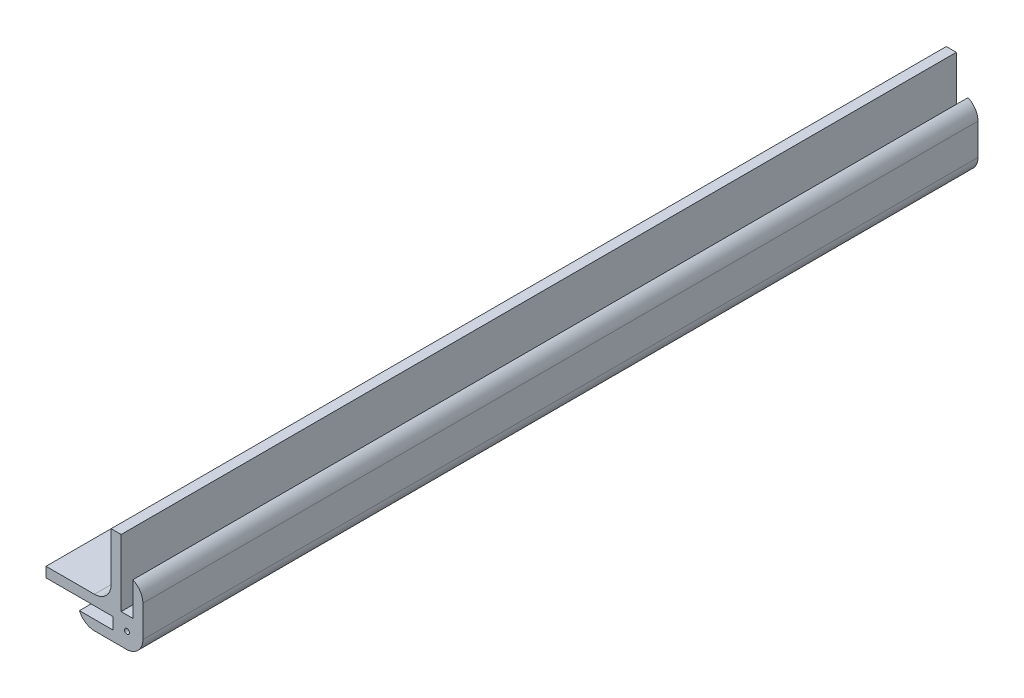
ISO-10303-21;
HEADER;
FILE_DESCRIPTION(('STEP AP214'),'2;1');
FILE_NAME('part.step','',(''),(''),'','','');
FILE_SCHEMA(('AUTOMOTIVE_DESIGN { 1 0 10303 214 1 1 1 1 }'));
ENDSEC;
DATA;
#1=APPLICATION_CONTEXT('core data for automotive mechanical design processes');
#2=APPLICATION_PROTOCOL_DEFINITION('international standard','automotive_design',2000,#1);
#3=PRODUCT_CONTEXT('',#1,'mechanical');
#4=PRODUCT('Part','Part','',(#3));
#5=PRODUCT_RELATED_PRODUCT_CATEGORY('part','',(#4));
#6=PRODUCT_DEFINITION_FORMATION('','',#4);
#7=PRODUCT_DEFINITION_CONTEXT('part definition',#1,'design');
#8=PRODUCT_DEFINITION('design','',#6,#7);
#9=PRODUCT_DEFINITION_SHAPE('','',#8);
#10=(LENGTH_UNIT() NAMED_UNIT(*) SI_UNIT(.MILLI.,.METRE.));
#11=(NAMED_UNIT(*) PLANE_ANGLE_UNIT() SI_UNIT($,.RADIAN.));
#12=(NAMED_UNIT(*) SI_UNIT($,.STERADIAN.) SOLID_ANGLE_UNIT());
#13=UNCERTAINTY_MEASURE_WITH_UNIT(LENGTH_MEASURE(1.E-05),#10,'distance_accuracy_value','');
#14=(GEOMETRIC_REPRESENTATION_CONTEXT(3) GLOBAL_UNCERTAINTY_ASSIGNED_CONTEXT((#13)) GLOBAL_UNIT_ASSIGNED_CONTEXT((#10,
#11,#12)) REPRESENTATION_CONTEXT('',''));
#15=CARTESIAN_POINT('',(0.,0.,0.));
#16=DIRECTION('',(0.,0.,1.));
#17=DIRECTION('',(1.,0.,0.));
#18=AXIS2_PLACEMENT_3D('',#15,#16,#17);
#19=CARTESIAN_POINT('',(0.,0.,250.));
#20=DIRECTION('',(-1.,0.,0.));
#21=DIRECTION('',(0.,-1.,0.));
#22=AXIS2_PLACEMENT_3D('',#19,#20,#21);
#23=PLANE('',#22);
#24=DIRECTION('',(0.,1.,0.));
#25=VECTOR('',#24,1.);
#26=CARTESIAN_POINT('',(0.,-2.99999999999999,250.));
#27=LINE('',#26,#25);
#28=CARTESIAN_POINT('',(0.,2.00000000000001,250.));
#29=VERTEX_POINT('',#28);
#30=CARTESIAN_POINT('',(0.,11.4174243050442,250.));
#31=VERTEX_POINT('',#30);
#32=EDGE_CURVE('E157',#29,#31,#27,.T.);
#33=ORIENTED_EDGE('',*,*,#32,.F.);
#34=DIRECTION('',(0.,0.,-1.));
#35=VECTOR('',#34,1.);
#36=CARTESIAN_POINT('',(0.,2.00000000000001,250.));
#37=LINE('',#36,#35);
#38=CARTESIAN_POINT('',(0.,2.00000000000001,0.));
#39=VERTEX_POINT('',#38);
#40=EDGE_CURVE('E210',#29,#39,#37,.T.);
#41=ORIENTED_EDGE('',*,*,#40,.T.);
#42=DIRECTION('',(0.,1.,0.));
#43=VECTOR('',#42,1.);
#44=CARTESIAN_POINT('',(0.,0.,0.));
#45=LINE('',#44,#43);
#46=CARTESIAN_POINT('',(0.,11.4174243050442,0.));
#47=VERTEX_POINT('',#46);
#48=EDGE_CURVE('E271',#39,#47,#45,.T.);
#49=ORIENTED_EDGE('',*,*,#48,.T.);
#50=DIRECTION('',(0.,0.,1.));
#51=VECTOR('',#50,1.);
#52=CARTESIAN_POINT('',(0.,11.4174243050442,250.));
#53=LINE('',#52,#51);
#54=EDGE_CURVE('E55',#47,#31,#53,.T.);
#55=ORIENTED_EDGE('',*,*,#54,.T.);
#56=EDGE_LOOP('',(#33,#41,#49,#55));
#57=FACE_BOUND('',#56,.T.);
#58=ADVANCED_FACE('F39',(#57),#23,.F.);
#59=CARTESIAN_POINT('',(-3.,16.,250.));
#60=DIRECTION('',(1.,0.,0.));
#61=DIRECTION('',(0.,1.,0.));
#62=AXIS2_PLACEMENT_3D('',#59,#60,#61);
#63=PLANE('',#62);
#64=DIRECTION('',(0.,-1.,0.));
#65=VECTOR('',#64,1.);
#66=CARTESIAN_POINT('',(-3.,16.,0.));
#67=LINE('',#66,#65);
#68=CARTESIAN_POINT('',(-3.,16.,0.));
#69=VERTEX_POINT('',#68);
#70=CARTESIAN_POINT('',(-3.,6.,0.));
#71=VERTEX_POINT('',#70);
#72=EDGE_CURVE('E274',#69,#71,#67,.T.);
#73=ORIENTED_EDGE('',*,*,#72,.T.);
#74=DIRECTION('',(0.,0.,-1.));
#75=VECTOR('',#74,1.);
#76=CARTESIAN_POINT('',(-3.,6.,250.));
#77=LINE('',#76,#75);
#78=CARTESIAN_POINT('',(-3.,6.,250.));
#79=VERTEX_POINT('',#78);
#80=EDGE_CURVE('E169',#79,#71,#77,.T.);
#81=ORIENTED_EDGE('',*,*,#80,.F.);
#82=DIRECTION('',(0.,-1.,0.));
#83=VECTOR('',#82,1.);
#84=CARTESIAN_POINT('',(-3.,16.,250.));
#85=LINE('',#84,#83);
#86=CARTESIAN_POINT('',(-3.,16.,250.));
#87=VERTEX_POINT('',#86);
#88=EDGE_CURVE('E155',#87,#79,#85,.T.);
#89=ORIENTED_EDGE('',*,*,#88,.F.);
#90=DIRECTION('',(0.,0.,-1.));
#91=VECTOR('',#90,1.);
#92=CARTESIAN_POINT('',(-3.,16.,250.));
#93=LINE('',#92,#91);
#94=EDGE_CURVE('E166',#87,#69,#93,.T.);
#95=ORIENTED_EDGE('',*,*,#94,.T.);
#96=EDGE_LOOP('',(#73,#81,#89,#95));
#97=FACE_BOUND('',#96,.T.);
#98=ADVANCED_FACE('F165',(#97),#63,.F.);
#99=CARTESIAN_POINT('',(-6.5,6.,250.));
#100=DIRECTION('',(0.,-1.,0.));
#101=DIRECTION('',(0.,0.,-1.));
#102=AXIS2_PLACEMENT_3D('',#99,#100,#101);
#103=PLANE('',#102);
#104=DIRECTION('',(-1.,0.,0.));
#105=VECTOR('',#104,1.);
#106=CARTESIAN_POINT('',(-6.5,6.,0.));
#107=LINE('',#106,#105);
#108=CARTESIAN_POINT('',(-6.5,6.,0.));
#109=VERTEX_POINT('',#108);
#110=EDGE_CURVE('E278',#71,#109,#107,.T.);
#111=ORIENTED_EDGE('',*,*,#110,.T.);
#112=DIRECTION('',(0.,0.,-1.));
#113=VECTOR('',#112,1.);
#114=CARTESIAN_POINT('',(-6.5,6.,250.));
#115=LINE('',#114,#113);
#116=CARTESIAN_POINT('',(-6.5,6.,250.));
#117=VERTEX_POINT('',#116);
#118=EDGE_CURVE('E183',#117,#109,#115,.T.);
#119=ORIENTED_EDGE('',*,*,#118,.F.);
#120=DIRECTION('',(-1.,0.,0.));
#121=VECTOR('',#120,1.);
#122=CARTESIAN_POINT('',(-6.5,6.,250.));
#123=LINE('',#122,#121);
#124=EDGE_CURVE('E172',#79,#117,#123,.T.);
#125=ORIENTED_EDGE('',*,*,#124,.F.);
#126=ORIENTED_EDGE('',*,*,#80,.T.);
#127=EDGE_LOOP('',(#111,#119,#125,#126));
#128=FACE_BOUND('',#127,.T.);
#129=ADVANCED_FACE('F392',(#128),#103,.F.);
#130=CARTESIAN_POINT('',(-6.5,6.,250.));
#131=DIRECTION('',(-1.,0.,0.));
#132=DIRECTION('',(0.,-1.,0.));
#133=AXIS2_PLACEMENT_3D('',#130,#131,#132);
#134=PLANE('',#133);
#135=DIRECTION('',(0.,1.,0.));
#136=VECTOR('',#135,1.);
#137=CARTESIAN_POINT('',(-6.5,6.,0.));
#138=LINE('',#137,#136);
#139=CARTESIAN_POINT('',(-6.5,26.,0.));
#140=VERTEX_POINT('',#139);
#141=EDGE_CURVE('E281',#109,#140,#138,.T.);
#142=ORIENTED_EDGE('',*,*,#141,.T.);
#143=DIRECTION('',(0.,0.,-1.));
#144=VECTOR('',#143,1.);
#145=CARTESIAN_POINT('',(-6.5,26.,250.));
#146=LINE('',#145,#144);
#147=CARTESIAN_POINT('',(-6.5,26.,250.));
#148=VERTEX_POINT('',#147);
#149=EDGE_CURVE('E324',#148,#140,#146,.T.);
#150=ORIENTED_EDGE('',*,*,#149,.F.);
#151=DIRECTION('',(0.,1.,0.));
#152=VECTOR('',#151,1.);
#153=CARTESIAN_POINT('',(-6.5,6.,250.));
#154=LINE('',#153,#152);
#155=EDGE_CURVE('E335',#117,#148,#154,.T.);
#156=ORIENTED_EDGE('',*,*,#155,.F.);
#157=ORIENTED_EDGE('',*,*,#118,.T.);
#158=EDGE_LOOP('',(#142,#150,#156,#157));
#159=FACE_BOUND('',#158,.T.);
#160=ADVANCED_FACE('F333',(#159),#134,.F.);
#161=CARTESIAN_POINT('',(-6.5,26.,250.));
#162=DIRECTION('',(0.,-1.,0.));
#163=DIRECTION('',(1.,0.,0.));
#164=AXIS2_PLACEMENT_3D('',#161,#162,#163);
#165=PLANE('',#164);
#166=DIRECTION('',(-1.,0.,0.));
#167=VECTOR('',#166,1.);
#168=CARTESIAN_POINT('',(-6.5,26.,0.));
#169=LINE('',#168,#167);
#170=CARTESIAN_POINT('',(-9.5,26.,0.));
#171=VERTEX_POINT('',#170);
#172=EDGE_CURVE('E235',#140,#171,#169,.T.);
#173=ORIENTED_EDGE('',*,*,#172,.T.);
#174=DIRECTION('',(0.,0.,-1.));
#175=VECTOR('',#174,1.);
#176=CARTESIAN_POINT('',(-9.5,26.,250.));
#177=LINE('',#176,#175);
#178=CARTESIAN_POINT('',(-9.5,26.,250.));
#179=VERTEX_POINT('',#178);
#180=EDGE_CURVE('E233',#179,#171,#177,.T.);
#181=ORIENTED_EDGE('',*,*,#180,.F.);
#182=DIRECTION('',(-1.,0.,0.));
#183=VECTOR('',#182,1.);
#184=CARTESIAN_POINT('',(-6.5,26.,250.));
#185=LINE('',#184,#183);
#186=EDGE_CURVE('E255',#148,#179,#185,.T.);
#187=ORIENTED_EDGE('',*,*,#186,.F.);
#188=ORIENTED_EDGE('',*,*,#149,.T.);
#189=EDGE_LOOP('',(#173,#181,#187,#188));
#190=FACE_BOUND('',#189,.T.);
#191=ADVANCED_FACE('F339',(#190),#165,.F.);
#192=CARTESIAN_POINT('',(-9.5,26.,250.));
#193=DIRECTION('',(1.,0.,0.));
#194=DIRECTION('',(0.,1.,0.));
#195=AXIS2_PLACEMENT_3D('',#192,#193,#194);
#196=PLANE('',#195);
#197=DIRECTION('',(0.,-1.,0.));
#198=VECTOR('',#197,1.);
#199=CARTESIAN_POINT('',(-9.5,26.,0.));
#200=LINE('',#199,#198);
#201=CARTESIAN_POINT('',(-9.49999999999999,11.5,0.));
#202=VERTEX_POINT('',#201);
#203=EDGE_CURVE('E221',#171,#202,#200,.T.);
#204=ORIENTED_EDGE('',*,*,#203,.T.);
#205=DIRECTION('',(0.,0.,-1.));
#206=VECTOR('',#205,1.);
#207=CARTESIAN_POINT('',(-9.49999999999999,11.5,250.));
#208=LINE('',#207,#206);
#209=CARTESIAN_POINT('',(-9.49999999999999,11.5,250.));
#210=VERTEX_POINT('',#209);
#211=EDGE_CURVE('E181',#202,#210,#208,.F.);
#212=ORIENTED_EDGE('',*,*,#211,.T.);
#213=DIRECTION('',(0.,-1.,0.));
#214=VECTOR('',#213,1.);
#215=CARTESIAN_POINT('',(-9.5,26.,250.));
#216=LINE('',#215,#214);
#217=EDGE_CURVE('E242',#179,#210,#216,.T.);
#218=ORIENTED_EDGE('',*,*,#217,.F.);
#219=ORIENTED_EDGE('',*,*,#180,.T.);
#220=EDGE_LOOP('',(#204,#212,#218,#219));
#221=FACE_BOUND('',#220,.T.);
#222=ADVANCED_FACE('F229',(#221),#196,.F.);
#223=CARTESIAN_POINT('',(-9.49999999999999,6.5,250.));
#224=DIRECTION('',(0.,-1.,0.));
#225=DIRECTION('',(1.,0.,0.));
#226=AXIS2_PLACEMENT_3D('',#223,#224,#225);
#227=PLANE('',#226);
#228=DIRECTION('',(-1.,0.,0.));
#229=VECTOR('',#228,1.);
#230=CARTESIAN_POINT('',(-9.49999999999999,6.5,250.));
#231=LINE('',#230,#229);
#232=CARTESIAN_POINT('',(-14.5,6.5,250.));
#233=VERTEX_POINT('',#232);
#234=CARTESIAN_POINT('',(-29.,6.5,250.));
#235=VERTEX_POINT('',#234);
#236=EDGE_CURVE('E240',#233,#235,#231,.T.);
#237=ORIENTED_EDGE('',*,*,#236,.F.);
#238=DIRECTION('',(0.,0.,-1.));
#239=VECTOR('',#238,1.);
#240=CARTESIAN_POINT('',(-14.5,6.5,0.));
#241=LINE('',#240,#239);
#242=CARTESIAN_POINT('',(-14.5,6.5,0.));
#243=VERTEX_POINT('',#242);
#244=EDGE_CURVE('E176',#233,#243,#241,.T.);
#245=ORIENTED_EDGE('',*,*,#244,.T.);
#246=DIRECTION('',(-1.,0.,0.));
#247=VECTOR('',#246,1.);
#248=CARTESIAN_POINT('',(-9.49999999999999,6.5,0.));
#249=LINE('',#248,#247);
#250=CARTESIAN_POINT('',(-29.,6.5,0.));
#251=VERTEX_POINT('',#250);
#252=EDGE_CURVE('E223',#243,#251,#249,.T.);
#253=ORIENTED_EDGE('',*,*,#252,.T.);
#254=DIRECTION('',(0.,0.,-1.));
#255=VECTOR('',#254,1.);
#256=CARTESIAN_POINT('',(-29.,6.5,250.));
#257=LINE('',#256,#255);
#258=EDGE_CURVE('E246',#235,#251,#257,.T.);
#259=ORIENTED_EDGE('',*,*,#258,.F.);
#260=EDGE_LOOP('',(#237,#245,#253,#259));
#261=FACE_BOUND('',#260,.T.);
#262=ADVANCED_FACE('F244',(#261),#227,.F.);
#263=CARTESIAN_POINT('',(-29.,6.5,250.));
#264=DIRECTION('',(1.,0.,0.));
#265=DIRECTION('',(0.,1.,0.));
#266=AXIS2_PLACEMENT_3D('',#263,#264,#265);
#267=PLANE('',#266);
#268=DIRECTION('',(0.,-1.,0.));
#269=VECTOR('',#268,1.);
#270=CARTESIAN_POINT('',(-29.,6.5,0.));
#271=LINE('',#270,#269);
#272=CARTESIAN_POINT('',(-29.,3.5,0.));
#273=VERTEX_POINT('',#272);
#274=EDGE_CURVE('E288',#251,#273,#271,.T.);
#275=ORIENTED_EDGE('',*,*,#274,.T.);
#276=DIRECTION('',(0.,0.,-1.));
#277=VECTOR('',#276,1.);
#278=CARTESIAN_POINT('',(-29.,3.5,250.));
#279=LINE('',#278,#277);
#280=CARTESIAN_POINT('',(-29.,3.5,250.));
#281=VERTEX_POINT('',#280);
#282=EDGE_CURVE('E316',#281,#273,#279,.T.);
#283=ORIENTED_EDGE('',*,*,#282,.F.);
#284=DIRECTION('',(0.,-1.,0.));
#285=VECTOR('',#284,1.);
#286=CARTESIAN_POINT('',(-29.,6.5,250.));
#287=LINE('',#286,#285);
#288=EDGE_CURVE('E249',#235,#281,#287,.T.);
#289=ORIENTED_EDGE('',*,*,#288,.F.);
#290=ORIENTED_EDGE('',*,*,#258,.T.);
#291=EDGE_LOOP('',(#275,#283,#289,#290));
#292=FACE_BOUND('',#291,.T.);
#293=ADVANCED_FACE('F423',(#292),#267,.F.);
#294=CARTESIAN_POINT('',(-29.,3.5,250.));
#295=DIRECTION('',(0.,1.,0.));
#296=DIRECTION('',(-1.,0.,0.));
#297=AXIS2_PLACEMENT_3D('',#294,#295,#296);
#298=PLANE('',#297);
#299=DIRECTION('',(1.,0.,0.));
#300=VECTOR('',#299,1.);
#301=CARTESIAN_POINT('',(-29.,3.5,0.));
#302=LINE('',#301,#300);
#303=CARTESIAN_POINT('',(-9.,3.5,0.));
#304=VERTEX_POINT('',#303);
#305=EDGE_CURVE('E291',#273,#304,#302,.T.);
#306=ORIENTED_EDGE('',*,*,#305,.T.);
#307=DIRECTION('',(0.,0.,-1.));
#308=VECTOR('',#307,1.);
#309=CARTESIAN_POINT('',(-9.,3.5,250.));
#310=LINE('',#309,#308);
#311=CARTESIAN_POINT('',(-9.,3.5,250.));
#312=VERTEX_POINT('',#311);
#313=EDGE_CURVE('E312',#312,#304,#310,.T.);
#314=ORIENTED_EDGE('',*,*,#313,.F.);
#315=DIRECTION('',(1.,0.,0.));
#316=VECTOR('',#315,1.);
#317=CARTESIAN_POINT('',(-29.,3.5,250.));
#318=LINE('',#317,#316);
#319=EDGE_CURVE('E253',#281,#312,#318,.T.);
#320=ORIENTED_EDGE('',*,*,#319,.F.);
#321=ORIENTED_EDGE('',*,*,#282,.T.);
#322=EDGE_LOOP('',(#306,#314,#320,#321));
#323=FACE_BOUND('',#322,.T.);
#324=ADVANCED_FACE('F426',(#323),#298,.F.);
#325=CARTESIAN_POINT('',(-9.,3.5,250.));
#326=DIRECTION('',(1.,0.,0.));
#327=DIRECTION('',(0.,1.,0.));
#328=AXIS2_PLACEMENT_3D('',#325,#326,#327);
#329=PLANE('',#328);
#330=DIRECTION('',(0.,-1.,0.));
#331=VECTOR('',#330,1.);
#332=CARTESIAN_POINT('',(-9.,3.5,0.));
#333=LINE('',#332,#331);
#334=CARTESIAN_POINT('',(-9.,0.,0.));
#335=VERTEX_POINT('',#334);
#336=EDGE_CURVE('E294',#304,#335,#333,.T.);
#337=ORIENTED_EDGE('',*,*,#336,.T.);
#338=DIRECTION('',(0.,0.,-1.));
#339=VECTOR('',#338,1.);
#340=CARTESIAN_POINT('',(-9.,0.,250.));
#341=LINE('',#340,#339);
#342=CARTESIAN_POINT('',(-9.,0.,250.));
#343=VERTEX_POINT('',#342);
#344=EDGE_CURVE('E308',#343,#335,#341,.T.);
#345=ORIENTED_EDGE('',*,*,#344,.F.);
#346=DIRECTION('',(0.,-1.,0.));
#347=VECTOR('',#346,1.);
#348=CARTESIAN_POINT('',(-9.,3.5,250.));
#349=LINE('',#348,#347);
#350=EDGE_CURVE('E261',#312,#343,#349,.T.);
#351=ORIENTED_EDGE('',*,*,#350,.F.);
#352=ORIENTED_EDGE('',*,*,#313,.T.);
#353=EDGE_LOOP('',(#337,#345,#351,#352));
#354=FACE_BOUND('',#353,.T.);
#355=ADVANCED_FACE('F430',(#354),#329,.F.);
#356=CARTESIAN_POINT('',(-9.,0.,250.));
#357=DIRECTION('',(0.,-1.,0.));
#358=DIRECTION('',(1.,0.,0.));
#359=AXIS2_PLACEMENT_3D('',#356,#357,#358);
#360=PLANE('',#359);
#361=DIRECTION('',(-1.,0.,0.));
#362=VECTOR('',#361,1.);
#363=CARTESIAN_POINT('',(-9.,0.,0.));
#364=LINE('',#363,#362);
#365=CARTESIAN_POINT('',(-19.,0.,0.));
#366=VERTEX_POINT('',#365);
#367=EDGE_CURVE('E297',#335,#366,#364,.T.);
#368=ORIENTED_EDGE('',*,*,#367,.T.);
#369=DIRECTION('',(0.,0.,-1.));
#370=VECTOR('',#369,1.);
#371=CARTESIAN_POINT('',(-19.,0.,250.));
#372=LINE('',#371,#370);
#373=CARTESIAN_POINT('',(-19.,0.,250.));
#374=VERTEX_POINT('',#373);
#375=EDGE_CURVE('E270',#374,#366,#372,.T.);
#376=ORIENTED_EDGE('',*,*,#375,.F.);
#377=DIRECTION('',(-1.,0.,0.));
#378=VECTOR('',#377,1.);
#379=CARTESIAN_POINT('',(-9.,0.,250.));
#380=LINE('',#379,#378);
#381=EDGE_CURVE('E264',#343,#374,#380,.T.);
#382=ORIENTED_EDGE('',*,*,#381,.F.);
#383=ORIENTED_EDGE('',*,*,#344,.T.);
#384=EDGE_LOOP('',(#368,#376,#382,#383));
#385=FACE_BOUND('',#384,.T.);
#386=ADVANCED_FACE('F383',(#385),#360,.F.);
#387=CARTESIAN_POINT('',(-19.,-3.,250.));
#388=DIRECTION('',(0.,1.,0.));
#389=DIRECTION('',(-1.,0.,0.));
#390=AXIS2_PLACEMENT_3D('',#387,#388,#389);
#391=PLANE('',#390);
#392=DIRECTION('',(1.,0.,0.));
#393=VECTOR('',#392,1.);
#394=CARTESIAN_POINT('',(-19.,-3.,250.));
#395=LINE('',#394,#393);
#396=CARTESIAN_POINT('',(-14.4174243050442,-3.,250.));
#397=VERTEX_POINT('',#396);
#398=CARTESIAN_POINT('',(-5.,-3.,250.));
#399=VERTEX_POINT('',#398);
#400=EDGE_CURVE('E267',#397,#399,#395,.T.);
#401=ORIENTED_EDGE('',*,*,#400,.F.);
#402=DIRECTION('',(0.,0.,-1.));
#403=VECTOR('',#402,1.);
#404=CARTESIAN_POINT('',(-14.4174243050442,-3.,250.));
#405=LINE('',#404,#403);
#406=CARTESIAN_POINT('',(-14.4174243050442,-3.,0.));
#407=VERTEX_POINT('',#406);
#408=EDGE_CURVE('E192',#397,#407,#405,.T.);
#409=ORIENTED_EDGE('',*,*,#408,.T.);
#410=DIRECTION('',(1.,0.,0.));
#411=VECTOR('',#410,1.);
#412=CARTESIAN_POINT('',(-19.,-3.,0.));
#413=LINE('',#412,#411);
#414=CARTESIAN_POINT('',(-5.,-3.,0.));
#415=VERTEX_POINT('',#414);
#416=EDGE_CURVE('E301',#407,#415,#413,.T.);
#417=ORIENTED_EDGE('',*,*,#416,.T.);
#418=DIRECTION('',(0.,0.,-1.));
#419=VECTOR('',#418,1.);
#420=CARTESIAN_POINT('',(-5.,-3.,250.));
#421=LINE('',#420,#419);
#422=EDGE_CURVE('E189',#415,#399,#421,.F.);
#423=ORIENTED_EDGE('',*,*,#422,.T.);
#424=EDGE_LOOP('',(#401,#409,#417,#423));
#425=FACE_BOUND('',#424,.T.);
#426=ADVANCED_FACE('F375',(#425),#391,.F.);
#427=CARTESIAN_POINT('',(0.,0.,250.));
#428=DIRECTION('',(0.,0.,1.));
#429=DIRECTION('',(1.,0.,0.));
#430=AXIS2_PLACEMENT_3D('',#427,#428,#429);
#431=PLANE('',#430);
#432=CARTESIAN_POINT('',(-4.75,1.75,250.));
#433=DIRECTION('',(0.,0.,1.));
#434=DIRECTION('',(1.,0.,0.));
#435=AXIS2_PLACEMENT_3D('',#432,#433,#434);
#436=CIRCLE('',#435,0.749999999999998);
#437=CARTESIAN_POINT('',(-4.,1.75,250.));
#438=VERTEX_POINT('',#437);
#439=EDGE_CURVE('E357',#438,#438,#436,.T.);
#440=ORIENTED_EDGE('',*,*,#439,.F.);
#441=EDGE_LOOP('',(#440));
#442=FACE_BOUND('',#441,.T.);
#443=ORIENTED_EDGE('',*,*,#381,.T.);
#444=CARTESIAN_POINT('',(-14.4174243050442,2.,250.));
#445=DIRECTION('',(0.,0.,1.));
#446=DIRECTION('',(1.,0.,0.));
#447=AXIS2_PLACEMENT_3D('',#444,#445,#446);
#448=CIRCLE('',#447,5.);
#449=EDGE_CURVE('E205',#374,#397,#448,.T.);
#450=ORIENTED_EDGE('',*,*,#449,.T.);
#451=ORIENTED_EDGE('',*,*,#400,.T.);
#452=CARTESIAN_POINT('',(-5.,2.,250.));
#453=DIRECTION('',(0.,0.,1.));
#454=DIRECTION('',(1.,0.,0.));
#455=AXIS2_PLACEMENT_3D('',#452,#453,#454);
#456=CIRCLE('',#455,5.);
#457=EDGE_CURVE('E62',#399,#29,#456,.T.);
#458=ORIENTED_EDGE('',*,*,#457,.T.);
#459=ORIENTED_EDGE('',*,*,#32,.T.);
#460=CARTESIAN_POINT('',(-5.,11.4174243050442,250.));
#461=DIRECTION('',(0.,0.,1.));
#462=DIRECTION('',(1.,0.,0.));
#463=AXIS2_PLACEMENT_3D('',#460,#461,#462);
#464=CIRCLE('',#463,5.);
#465=EDGE_CURVE('E152',#31,#87,#464,.T.);
#466=ORIENTED_EDGE('',*,*,#465,.T.);
#467=ORIENTED_EDGE('',*,*,#88,.T.);
#468=ORIENTED_EDGE('',*,*,#124,.T.);
#469=ORIENTED_EDGE('',*,*,#155,.T.);
#470=ORIENTED_EDGE('',*,*,#186,.T.);
#471=ORIENTED_EDGE('',*,*,#217,.T.);
#472=CARTESIAN_POINT('',(-14.5,11.5,250.));
#473=DIRECTION('',(0.,0.,1.));
#474=DIRECTION('',(1.,0.,0.));
#475=AXIS2_PLACEMENT_3D('',#472,#473,#474);
#476=CIRCLE('',#475,5.);
#477=EDGE_CURVE('E11',#210,#233,#476,.F.);
#478=ORIENTED_EDGE('',*,*,#477,.T.);
#479=ORIENTED_EDGE('',*,*,#236,.T.);
#480=ORIENTED_EDGE('',*,*,#288,.T.);
#481=ORIENTED_EDGE('',*,*,#319,.T.);
#482=ORIENTED_EDGE('',*,*,#350,.T.);
#483=EDGE_LOOP('',(#443,#450,#451,#458,#459,#466,#467,#468,#469,#470,#471,#478,#479,#480,#481,#482));
#484=FACE_BOUND('',#483,.T.);
#485=ADVANCED_FACE('F154',(#442,#484),#431,.T.);
#486=CARTESIAN_POINT('',(0.,0.,0.));
#487=DIRECTION('',(0.,0.,1.));
#488=DIRECTION('',(1.,0.,0.));
#489=AXIS2_PLACEMENT_3D('',#486,#487,#488);
#490=PLANE('',#489);
#491=CARTESIAN_POINT('',(-4.75,1.75,0.));
#492=DIRECTION('',(0.,0.,-1.));
#493=DIRECTION('',(-1.,0.,0.));
#494=AXIS2_PLACEMENT_3D('',#491,#492,#493);
#495=CIRCLE('',#494,0.749999999999999);
#496=CARTESIAN_POINT('',(-5.5,1.75,0.));
#497=VERTEX_POINT('',#496);
#498=EDGE_CURVE('E349',#497,#497,#495,.T.);
#499=ORIENTED_EDGE('',*,*,#498,.F.);
#500=EDGE_LOOP('',(#499));
#501=FACE_BOUND('',#500,.T.);
#502=ORIENTED_EDGE('',*,*,#416,.F.);
#503=CARTESIAN_POINT('',(-14.4174243050442,2.,0.));
#504=DIRECTION('',(0.,0.,1.));
#505=DIRECTION('',(1.,0.,0.));
#506=AXIS2_PLACEMENT_3D('',#503,#504,#505);
#507=CIRCLE('',#506,5.);
#508=EDGE_CURVE('E161',#407,#366,#507,.F.);
#509=ORIENTED_EDGE('',*,*,#508,.T.);
#510=ORIENTED_EDGE('',*,*,#367,.F.);
#511=ORIENTED_EDGE('',*,*,#336,.F.);
#512=ORIENTED_EDGE('',*,*,#305,.F.);
#513=ORIENTED_EDGE('',*,*,#274,.F.);
#514=ORIENTED_EDGE('',*,*,#252,.F.);
#515=CARTESIAN_POINT('',(-14.5,11.5,0.));
#516=DIRECTION('',(0.,0.,1.));
#517=DIRECTION('',(1.,0.,0.));
#518=AXIS2_PLACEMENT_3D('',#515,#516,#517);
#519=CIRCLE('',#518,5.);
#520=EDGE_CURVE('E48',#243,#202,#519,.T.);
#521=ORIENTED_EDGE('',*,*,#520,.T.);
#522=ORIENTED_EDGE('',*,*,#203,.F.);
#523=ORIENTED_EDGE('',*,*,#172,.F.);
#524=ORIENTED_EDGE('',*,*,#141,.F.);
#525=ORIENTED_EDGE('',*,*,#110,.F.);
#526=ORIENTED_EDGE('',*,*,#72,.F.);
#527=CARTESIAN_POINT('',(-5.,11.4174243050442,0.));
#528=DIRECTION('',(0.,0.,1.));
#529=DIRECTION('',(1.,0.,0.));
#530=AXIS2_PLACEMENT_3D('',#527,#528,#529);
#531=CIRCLE('',#530,5.);
#532=EDGE_CURVE('E174',#69,#47,#531,.F.);
#533=ORIENTED_EDGE('',*,*,#532,.T.);
#534=ORIENTED_EDGE('',*,*,#48,.F.);
#535=CARTESIAN_POINT('',(-5.,2.,0.));
#536=DIRECTION('',(0.,0.,1.));
#537=DIRECTION('',(1.,0.,0.));
#538=AXIS2_PLACEMENT_3D('',#535,#536,#537);
#539=CIRCLE('',#538,5.);
#540=EDGE_CURVE('E198',#39,#415,#539,.F.);
#541=ORIENTED_EDGE('',*,*,#540,.T.);
#542=EDGE_LOOP('',(#502,#509,#510,#511,#512,#513,#514,#521,#522,#523,#524,#525,#526,#533,#534,#541));
#543=FACE_BOUND('',#542,.T.);
#544=ADVANCED_FACE('F219',(#501,#543),#490,.F.);
#545=CARTESIAN_POINT('',(-14.5,11.5,250.));
#546=DIRECTION('',(0.,0.,1.));
#547=DIRECTION('',(1.,0.,0.));
#548=AXIS2_PLACEMENT_3D('',#545,#546,#547);
#549=CYLINDRICAL_SURFACE('',#548,5.);
#550=ORIENTED_EDGE('',*,*,#477,.F.);
#551=ORIENTED_EDGE('',*,*,#211,.F.);
#552=ORIENTED_EDGE('',*,*,#520,.F.);
#553=ORIENTED_EDGE('',*,*,#244,.F.);
#554=EDGE_LOOP('',(#550,#551,#552,#553));
#555=FACE_BOUND('',#554,.T.);
#556=ADVANCED_FACE('F238',(#555),#549,.F.);
#557=CARTESIAN_POINT('',(-14.4174243050442,2.,250.));
#558=DIRECTION('',(0.,0.,-1.));
#559=DIRECTION('',(-1.,0.,0.));
#560=AXIS2_PLACEMENT_3D('',#557,#558,#559);
#561=CYLINDRICAL_SURFACE('',#560,5.);
#562=ORIENTED_EDGE('',*,*,#449,.F.);
#563=ORIENTED_EDGE('',*,*,#375,.T.);
#564=ORIENTED_EDGE('',*,*,#508,.F.);
#565=ORIENTED_EDGE('',*,*,#408,.F.);
#566=EDGE_LOOP('',(#562,#563,#564,#565));
#567=FACE_BOUND('',#566,.T.);
#568=ADVANCED_FACE('F398',(#567),#561,.T.);
#569=CARTESIAN_POINT('',(-5.,2.,250.));
#570=DIRECTION('',(0.,0.,-1.));
#571=DIRECTION('',(-1.,0.,0.));
#572=AXIS2_PLACEMENT_3D('',#569,#570,#571);
#573=CYLINDRICAL_SURFACE('',#572,5.);
#574=ORIENTED_EDGE('',*,*,#457,.F.);
#575=ORIENTED_EDGE('',*,*,#422,.F.);
#576=ORIENTED_EDGE('',*,*,#540,.F.);
#577=ORIENTED_EDGE('',*,*,#40,.F.);
#578=EDGE_LOOP('',(#574,#575,#576,#577));
#579=FACE_BOUND('',#578,.T.);
#580=ADVANCED_FACE('F400',(#579),#573,.T.);
#581=CARTESIAN_POINT('',(-5.,11.4174243050442,250.));
#582=DIRECTION('',(0.,0.,1.));
#583=DIRECTION('',(1.,0.,0.));
#584=AXIS2_PLACEMENT_3D('',#581,#582,#583);
#585=CYLINDRICAL_SURFACE('',#584,5.);
#586=ORIENTED_EDGE('',*,*,#465,.F.);
#587=ORIENTED_EDGE('',*,*,#54,.F.);
#588=ORIENTED_EDGE('',*,*,#532,.F.);
#589=ORIENTED_EDGE('',*,*,#94,.F.);
#590=EDGE_LOOP('',(#586,#587,#588,#589));
#591=FACE_BOUND('',#590,.T.);
#592=ADVANCED_FACE('F41',(#591),#585,.T.);
#593=CARTESIAN_POINT('',(-4.75,1.75,20.));
#594=DIRECTION('',(0.,0.,-1.));
#595=DIRECTION('',(-1.,0.,0.));
#596=AXIS2_PLACEMENT_3D('',#593,#594,#595);
#597=CYLINDRICAL_SURFACE('',#596,0.749999999999999);
#598=CARTESIAN_POINT('',(-4.75,1.75,20.));
#599=DIRECTION('',(0.,0.,-1.));
#600=DIRECTION('',(-1.,0.,0.));
#601=AXIS2_PLACEMENT_3D('',#598,#599,#600);
#602=CIRCLE('',#601,0.749999999999999);
#603=CARTESIAN_POINT('',(-5.5,1.75,20.));
#604=VERTEX_POINT('',#603);
#605=EDGE_CURVE('E275',#604,#604,#602,.T.);
#606=ORIENTED_EDGE('',*,*,#605,.F.);
#607=EDGE_LOOP('',(#606));
#608=FACE_BOUND('',#607,.T.);
#609=ORIENTED_EDGE('',*,*,#498,.T.);
#610=EDGE_LOOP('',(#609));
#611=FACE_BOUND('',#610,.T.);
#612=ADVANCED_FACE('F407',(#608,#611),#597,.F.);
#613=CARTESIAN_POINT('',(-4.75,1.75,20.));
#614=DIRECTION('',(0.,0.,-1.));
#615=DIRECTION('',(-1.,0.,0.));
#616=AXIS2_PLACEMENT_3D('',#613,#614,#615);
#617=PLANE('',#616);
#618=ORIENTED_EDGE('',*,*,#605,.T.);
#619=EDGE_LOOP('',(#618));
#620=FACE_BOUND('',#619,.T.);
#621=ADVANCED_FACE('F370',(#620),#617,.T.);
#622=CARTESIAN_POINT('',(-4.75,1.75,230.));
#623=DIRECTION('',(0.,0.,1.));
#624=DIRECTION('',(1.,0.,0.));
#625=AXIS2_PLACEMENT_3D('',#622,#623,#624);
#626=CYLINDRICAL_SURFACE('',#625,0.749999999999998);
#627=CARTESIAN_POINT('',(-4.75,1.75,230.));
#628=DIRECTION('',(0.,0.,1.));
#629=DIRECTION('',(1.,0.,0.));
#630=AXIS2_PLACEMENT_3D('',#627,#628,#629);
#631=CIRCLE('',#630,0.749999999999998);
#632=CARTESIAN_POINT('',(-4.,1.75,230.));
#633=VERTEX_POINT('',#632);
#634=EDGE_CURVE('E353',#633,#633,#631,.T.);
#635=ORIENTED_EDGE('',*,*,#634,.F.);
#636=EDGE_LOOP('',(#635));
#637=FACE_BOUND('',#636,.T.);
#638=ORIENTED_EDGE('',*,*,#439,.T.);
#639=EDGE_LOOP('',(#638));
#640=FACE_BOUND('',#639,.T.);
#641=ADVANCED_FACE('F367',(#637,#640),#626,.F.);
#642=CARTESIAN_POINT('',(-4.75,1.75,230.));
#643=DIRECTION('',(0.,0.,1.));
#644=DIRECTION('',(1.,0.,0.));
#645=AXIS2_PLACEMENT_3D('',#642,#643,#644);
#646=PLANE('',#645);
#647=ORIENTED_EDGE('',*,*,#634,.T.);
#648=EDGE_LOOP('',(#647));
#649=FACE_BOUND('',#648,.T.);
#650=ADVANCED_FACE('F365',(#649),#646,.T.);
#651=CLOSED_SHELL('',(#58,#98,#129,#160,#191,#222,#262,#293,#324,#355,#386,#426,#485,#544,#556,
#568,#580,#592,#612,#621,#641,#650));
#652=MANIFOLD_SOLID_BREP('B2',#651);
#653=ADVANCED_BREP_SHAPE_REPRESENTATION('',(#18,#652),#14);
#654=SHAPE_DEFINITION_REPRESENTATION(#9,#653);
ENDSEC;
END-ISO-10303-21;
